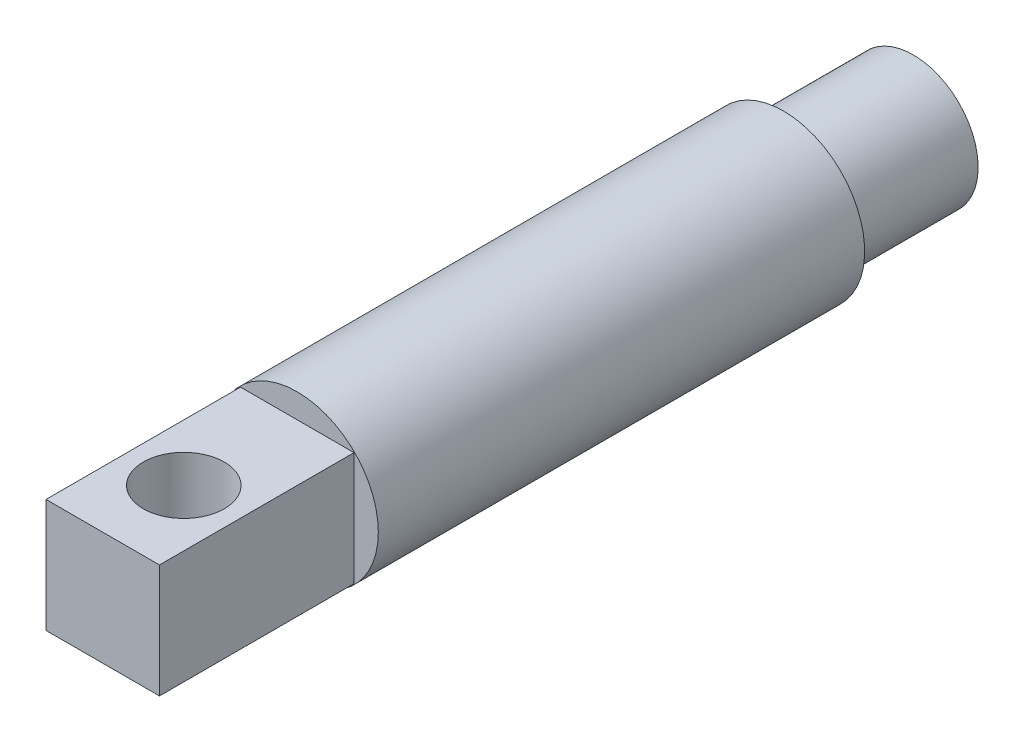
ISO-10303-21;
HEADER;
FILE_DESCRIPTION(('STEP AP214'),'2;1');
FILE_NAME('part.step','',(''),(''),'','','');
FILE_SCHEMA(('AUTOMOTIVE_DESIGN { 1 0 10303 214 1 1 1 1 }'));
ENDSEC;
DATA;
#1=APPLICATION_CONTEXT('core data for automotive mechanical design processes');
#2=APPLICATION_PROTOCOL_DEFINITION('international standard','automotive_design',2000,#1);
#3=PRODUCT_CONTEXT('',#1,'mechanical');
#4=PRODUCT('Part','Part','',(#3));
#5=PRODUCT_RELATED_PRODUCT_CATEGORY('part','',(#4));
#6=PRODUCT_DEFINITION_FORMATION('','',#4);
#7=PRODUCT_DEFINITION_CONTEXT('part definition',#1,'design');
#8=PRODUCT_DEFINITION('design','',#6,#7);
#9=PRODUCT_DEFINITION_SHAPE('','',#8);
#10=(LENGTH_UNIT() NAMED_UNIT(*) SI_UNIT(.MILLI.,.METRE.));
#11=(NAMED_UNIT(*) PLANE_ANGLE_UNIT() SI_UNIT($,.RADIAN.));
#12=(NAMED_UNIT(*) SI_UNIT($,.STERADIAN.) SOLID_ANGLE_UNIT());
#13=UNCERTAINTY_MEASURE_WITH_UNIT(LENGTH_MEASURE(1.E-05),#10,'distance_accuracy_value','');
#14=(GEOMETRIC_REPRESENTATION_CONTEXT(3) GLOBAL_UNCERTAINTY_ASSIGNED_CONTEXT((#13)) GLOBAL_UNIT_ASSIGNED_CONTEXT((#10,
#11,#12)) REPRESENTATION_CONTEXT('',''));
#15=CARTESIAN_POINT('',(0.,0.,0.));
#16=DIRECTION('',(0.,0.,1.));
#17=DIRECTION('',(1.,0.,0.));
#18=AXIS2_PLACEMENT_3D('',#15,#16,#17);
#19=CARTESIAN_POINT('',(0.,0.,70.));
#20=DIRECTION('',(0.,0.,-1.));
#21=DIRECTION('',(-1.,0.,0.));
#22=AXIS2_PLACEMENT_3D('',#19,#20,#21);
#23=CYLINDRICAL_SURFACE('',#22,5.);
#24=CARTESIAN_POINT('',(0.,0.,26.));
#25=DIRECTION('',(0.,0.,1.));
#26=DIRECTION('',(1.,0.,0.));
#27=AXIS2_PLACEMENT_3D('',#24,#25,#26);
#28=CIRCLE('',#27,5.);
#29=CARTESIAN_POINT('',(5.,0.,26.));
#30=VERTEX_POINT('',#29);
#31=EDGE_CURVE('E1027',#30,#30,#28,.T.);
#32=ORIENTED_EDGE('',*,*,#31,.F.);
#33=EDGE_LOOP('',(#32));
#34=FACE_BOUND('',#33,.T.);
#35=CARTESIAN_POINT('',(0.,0.,-4.));
#36=DIRECTION('',(0.,0.,-1.));
#37=DIRECTION('',(-1.,0.,0.));
#38=AXIS2_PLACEMENT_3D('',#35,#36,#37);
#39=CIRCLE('',#38,5.);
#40=CARTESIAN_POINT('',(-5.,0.,-4.));
#41=VERTEX_POINT('',#40);
#42=EDGE_CURVE('E1057',#41,#41,#39,.T.);
#43=ORIENTED_EDGE('',*,*,#42,.F.);
#44=EDGE_LOOP('',(#43));
#45=FACE_BOUND('',#44,.T.);
#46=ADVANCED_FACE('F950',(#34,#45),#23,.T.);
#47=CARTESIAN_POINT('',(0.,0.,26.));
#48=DIRECTION('',(0.,0.,1.));
#49=DIRECTION('',(1.,0.,0.));
#50=AXIS2_PLACEMENT_3D('',#47,#48,#49);
#51=PLANE('',#50);
#52=DIRECTION('',(1.,0.,0.));
#53=VECTOR('',#52,1.);
#54=CARTESIAN_POINT('',(-3.5,-3.5,26.));
#55=LINE('',#54,#53);
#56=CARTESIAN_POINT('',(-3.5,-3.5,26.));
#57=VERTEX_POINT('',#56);
#58=CARTESIAN_POINT('',(3.5,-3.5,26.));
#59=VERTEX_POINT('',#58);
#60=EDGE_CURVE('E1002',#57,#59,#55,.T.);
#61=ORIENTED_EDGE('',*,*,#60,.F.);
#62=DIRECTION('',(0.,-1.,0.));
#63=VECTOR('',#62,1.);
#64=CARTESIAN_POINT('',(-3.5,-3.5,26.));
#65=LINE('',#64,#63);
#66=CARTESIAN_POINT('',(-3.5,3.5,26.));
#67=VERTEX_POINT('',#66);
#68=EDGE_CURVE('E972',#67,#57,#65,.T.);
#69=ORIENTED_EDGE('',*,*,#68,.F.);
#70=DIRECTION('',(-1.,0.,0.));
#71=VECTOR('',#70,1.);
#72=CARTESIAN_POINT('',(-3.5,3.5,26.));
#73=LINE('',#72,#71);
#74=CARTESIAN_POINT('',(3.5,3.5,26.));
#75=VERTEX_POINT('',#74);
#76=EDGE_CURVE('E994',#75,#67,#73,.T.);
#77=ORIENTED_EDGE('',*,*,#76,.F.);
#78=DIRECTION('',(0.,1.,0.));
#79=VECTOR('',#78,1.);
#80=CARTESIAN_POINT('',(3.5,-3.5,26.));
#81=LINE('',#80,#79);
#82=EDGE_CURVE('E1007',#59,#75,#81,.T.);
#83=ORIENTED_EDGE('',*,*,#82,.F.);
#84=EDGE_LOOP('',(#61,#69,#77,#83));
#85=FACE_BOUND('',#84,.T.);
#86=ORIENTED_EDGE('',*,*,#31,.T.);
#87=EDGE_LOOP('',(#86));
#88=FACE_BOUND('',#87,.T.);
#89=ADVANCED_FACE('F1005',(#85,#88),#51,.T.);
#90=CARTESIAN_POINT('',(3.5,-3.5,26.));
#91=DIRECTION('',(1.,0.,0.));
#92=DIRECTION('',(0.,0.,-1.));
#93=AXIS2_PLACEMENT_3D('',#90,#91,#92);
#94=PLANE('',#93);
#95=DIRECTION('',(0.,1.,0.));
#96=VECTOR('',#95,1.);
#97=CARTESIAN_POINT('',(3.5,-3.5,38.));
#98=LINE('',#97,#96);
#99=CARTESIAN_POINT('',(3.5,-3.5,38.));
#100=VERTEX_POINT('',#99);
#101=CARTESIAN_POINT('',(3.5,3.5,38.));
#102=VERTEX_POINT('',#101);
#103=EDGE_CURVE('E1022',#100,#102,#98,.T.);
#104=ORIENTED_EDGE('',*,*,#103,.F.);
#105=DIRECTION('',(0.,0.,1.));
#106=VECTOR('',#105,1.);
#107=CARTESIAN_POINT('',(3.5,-3.5,26.));
#108=LINE('',#107,#106);
#109=EDGE_CURVE('E1011',#59,#100,#108,.T.);
#110=ORIENTED_EDGE('',*,*,#109,.F.);
#111=ORIENTED_EDGE('',*,*,#82,.T.);
#112=DIRECTION('',(0.,0.,1.));
#113=VECTOR('',#112,1.);
#114=CARTESIAN_POINT('',(3.5,3.5,26.));
#115=LINE('',#114,#113);
#116=EDGE_CURVE('E992',#75,#102,#115,.T.);
#117=ORIENTED_EDGE('',*,*,#116,.T.);
#118=EDGE_LOOP('',(#104,#110,#111,#117));
#119=FACE_BOUND('',#118,.T.);
#120=ADVANCED_FACE('F1010',(#119),#94,.T.);
#121=CARTESIAN_POINT('',(-3.5,-3.5,26.));
#122=DIRECTION('',(0.,-1.,0.));
#123=DIRECTION('',(0.,0.,-1.));
#124=AXIS2_PLACEMENT_3D('',#121,#122,#123);
#125=PLANE('',#124);
#126=CARTESIAN_POINT('',(0.,-3.5,33.));
#127=DIRECTION('',(0.,-1.,0.));
#128=DIRECTION('',(0.,0.,-1.));
#129=AXIS2_PLACEMENT_3D('',#126,#127,#128);
#130=CIRCLE('',#129,2.5);
#131=CARTESIAN_POINT('',(0.,-3.5,30.5));
#132=VERTEX_POINT('',#131);
#133=EDGE_CURVE('E1017',#132,#132,#130,.T.);
#134=ORIENTED_EDGE('',*,*,#133,.F.);
#135=EDGE_LOOP('',(#134));
#136=FACE_BOUND('',#135,.T.);
#137=DIRECTION('',(1.,0.,0.));
#138=VECTOR('',#137,1.);
#139=CARTESIAN_POINT('',(-3.5,-3.5,38.));
#140=LINE('',#139,#138);
#141=CARTESIAN_POINT('',(-3.5,-3.5,38.));
#142=VERTEX_POINT('',#141);
#143=EDGE_CURVE('E1012',#142,#100,#140,.T.);
#144=ORIENTED_EDGE('',*,*,#143,.F.);
#145=DIRECTION('',(0.,0.,1.));
#146=VECTOR('',#145,1.);
#147=CARTESIAN_POINT('',(-3.5,-3.5,26.));
#148=LINE('',#147,#146);
#149=EDGE_CURVE('E1028',#57,#142,#148,.T.);
#150=ORIENTED_EDGE('',*,*,#149,.F.);
#151=ORIENTED_EDGE('',*,*,#60,.T.);
#152=ORIENTED_EDGE('',*,*,#109,.T.);
#153=EDGE_LOOP('',(#144,#150,#151,#152));
#154=FACE_BOUND('',#153,.T.);
#155=ADVANCED_FACE('F1069',(#136,#154),#125,.T.);
#156=CARTESIAN_POINT('',(-3.5,-3.5,26.));
#157=DIRECTION('',(-1.,0.,0.));
#158=DIRECTION('',(0.,0.,1.));
#159=AXIS2_PLACEMENT_3D('',#156,#157,#158);
#160=PLANE('',#159);
#161=DIRECTION('',(0.,-1.,0.));
#162=VECTOR('',#161,1.);
#163=CARTESIAN_POINT('',(-3.5,-3.5,38.));
#164=LINE('',#163,#162);
#165=CARTESIAN_POINT('',(-3.5,3.5,38.));
#166=VERTEX_POINT('',#165);
#167=EDGE_CURVE('E964',#166,#142,#164,.T.);
#168=ORIENTED_EDGE('',*,*,#167,.F.);
#169=DIRECTION('',(0.,0.,1.));
#170=VECTOR('',#169,1.);
#171=CARTESIAN_POINT('',(-3.5,3.5,26.));
#172=LINE('',#171,#170);
#173=EDGE_CURVE('E1001',#67,#166,#172,.T.);
#174=ORIENTED_EDGE('',*,*,#173,.F.);
#175=ORIENTED_EDGE('',*,*,#68,.T.);
#176=ORIENTED_EDGE('',*,*,#149,.T.);
#177=EDGE_LOOP('',(#168,#174,#175,#176));
#178=FACE_BOUND('',#177,.T.);
#179=ADVANCED_FACE('F1072',(#178),#160,.T.);
#180=CARTESIAN_POINT('',(-3.5,3.5,26.));
#181=DIRECTION('',(0.,1.,0.));
#182=DIRECTION('',(0.,0.,1.));
#183=AXIS2_PLACEMENT_3D('',#180,#181,#182);
#184=PLANE('',#183);
#185=CARTESIAN_POINT('',(0.,3.5,33.));
#186=DIRECTION('',(0.,1.,0.));
#187=DIRECTION('',(0.,0.,1.));
#188=AXIS2_PLACEMENT_3D('',#185,#186,#187);
#189=CIRCLE('',#188,2.5);
#190=CARTESIAN_POINT('',(0.,3.5,35.5));
#191=VERTEX_POINT('',#190);
#192=EDGE_CURVE('E1059',#191,#191,#189,.T.);
#193=ORIENTED_EDGE('',*,*,#192,.F.);
#194=EDGE_LOOP('',(#193));
#195=FACE_BOUND('',#194,.T.);
#196=DIRECTION('',(-1.,0.,0.));
#197=VECTOR('',#196,1.);
#198=CARTESIAN_POINT('',(-3.5,3.5,38.));
#199=LINE('',#198,#197);
#200=EDGE_CURVE('E996',#102,#166,#199,.T.);
#201=ORIENTED_EDGE('',*,*,#200,.F.);
#202=ORIENTED_EDGE('',*,*,#116,.F.);
#203=ORIENTED_EDGE('',*,*,#76,.T.);
#204=ORIENTED_EDGE('',*,*,#173,.T.);
#205=EDGE_LOOP('',(#201,#202,#203,#204));
#206=FACE_BOUND('',#205,.T.);
#207=ADVANCED_FACE('F993',(#195,#206),#184,.T.);
#208=CARTESIAN_POINT('',(0.,0.,38.));
#209=DIRECTION('',(0.,0.,1.));
#210=DIRECTION('',(1.,0.,0.));
#211=AXIS2_PLACEMENT_3D('',#208,#209,#210);
#212=PLANE('',#211);
#213=ORIENTED_EDGE('',*,*,#143,.T.);
#214=ORIENTED_EDGE('',*,*,#103,.T.);
#215=ORIENTED_EDGE('',*,*,#200,.T.);
#216=ORIENTED_EDGE('',*,*,#167,.T.);
#217=EDGE_LOOP('',(#213,#214,#215,#216));
#218=FACE_BOUND('',#217,.T.);
#219=ADVANCED_FACE('F1076',(#218),#212,.T.);
#220=CARTESIAN_POINT('',(0.,-5.,33.));
#221=DIRECTION('',(0.,1.,0.));
#222=DIRECTION('',(0.,0.,1.));
#223=AXIS2_PLACEMENT_3D('',#220,#221,#222);
#224=CYLINDRICAL_SURFACE('',#223,2.5);
#225=ORIENTED_EDGE('',*,*,#133,.T.);
#226=EDGE_LOOP('',(#225));
#227=FACE_BOUND('',#226,.T.);
#228=ORIENTED_EDGE('',*,*,#192,.T.);
#229=EDGE_LOOP('',(#228));
#230=FACE_BOUND('',#229,.T.);
#231=ADVANCED_FACE('F1067',(#227,#230),#224,.F.);
#232=CARTESIAN_POINT('',(0.,0.,-4.));
#233=DIRECTION('',(0.,0.,-1.));
#234=DIRECTION('',(-1.,0.,0.));
#235=AXIS2_PLACEMENT_3D('',#232,#233,#234);
#236=PLANE('',#235);
#237=ORIENTED_EDGE('',*,*,#42,.T.);
#238=EDGE_LOOP('',(#237));
#239=FACE_BOUND('',#238,.T.);
#240=CARTESIAN_POINT('',(0.,0.,-4.));
#241=DIRECTION('',(0.,0.,-1.));
#242=DIRECTION('',(-1.,0.,0.));
#243=AXIS2_PLACEMENT_3D('',#240,#241,#242);
#244=CIRCLE('',#243,4.);
#245=CARTESIAN_POINT('',(-4.,0.,-4.));
#246=VERTEX_POINT('',#245);
#247=EDGE_CURVE('E12',#246,#246,#244,.F.);
#248=ORIENTED_EDGE('',*,*,#247,.T.);
#249=EDGE_LOOP('',(#248));
#250=FACE_BOUND('',#249,.T.);
#251=ADVANCED_FACE('F1044',(#239,#250),#236,.T.);
#252=CARTESIAN_POINT('',(0.,0.,-12.));
#253=DIRECTION('',(0.,0.,-1.));
#254=DIRECTION('',(-1.,0.,0.));
#255=AXIS2_PLACEMENT_3D('',#252,#253,#254);
#256=PLANE('',#255);
#257=CARTESIAN_POINT('',(0.,0.,-12.));
#258=DIRECTION('',(0.,0.,-1.));
#259=DIRECTION('',(-1.,0.,0.));
#260=AXIS2_PLACEMENT_3D('',#257,#258,#259);
#261=CIRCLE('',#260,4.);
#262=CARTESIAN_POINT('',(-4.,0.,-12.));
#263=VERTEX_POINT('',#262);
#264=EDGE_CURVE('E957',#263,#263,#261,.T.);
#265=ORIENTED_EDGE('',*,*,#264,.T.);
#266=EDGE_LOOP('',(#265));
#267=FACE_BOUND('',#266,.T.);
#268=ADVANCED_FACE('F1035',(#267),#256,.T.);
#269=CARTESIAN_POINT('',(0.,0.,0.));
#270=DIRECTION('',(0.,0.,-1.));
#271=DIRECTION('',(-1.,0.,0.));
#272=AXIS2_PLACEMENT_3D('',#269,#270,#271);
#273=CYLINDRICAL_SURFACE('',#272,4.);
#274=ORIENTED_EDGE('',*,*,#247,.F.);
#275=EDGE_LOOP('',(#274));
#276=FACE_BOUND('',#275,.T.);
#277=ORIENTED_EDGE('',*,*,#264,.F.);
#278=EDGE_LOOP('',(#277));
#279=FACE_BOUND('',#278,.T.);
#280=ADVANCED_FACE('F1037',(#276,#279),#273,.T.);
#281=CLOSED_SHELL('',(#46,#89,#120,#155,#179,#207,#219,#231,#251,#268,#280));
#282=MANIFOLD_SOLID_BREP('B2',#281);
#283=ADVANCED_BREP_SHAPE_REPRESENTATION('',(#18,#282),#14);
#284=SHAPE_DEFINITION_REPRESENTATION(#9,#283);
ENDSEC;
END-ISO-10303-21;
